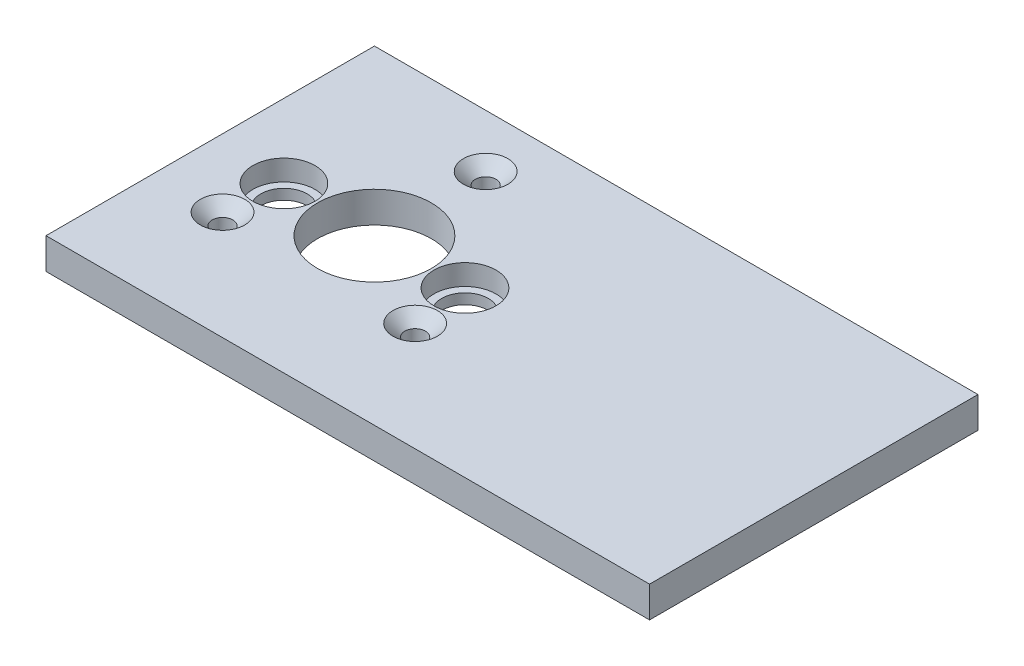
ISO-10303-21;
HEADER;
FILE_DESCRIPTION(('STEP AP214'),'2;1');
FILE_NAME('part.step','',(''),(''),'','','');
FILE_SCHEMA(('AUTOMOTIVE_DESIGN { 1 0 10303 214 1 1 1 1 }'));
ENDSEC;
DATA;
#1=APPLICATION_CONTEXT('core data for automotive mechanical design processes');
#2=APPLICATION_PROTOCOL_DEFINITION('international standard','automotive_design',2000,#1);
#3=PRODUCT_CONTEXT('',#1,'mechanical');
#4=PRODUCT('Part','Part','',(#3));
#5=PRODUCT_RELATED_PRODUCT_CATEGORY('part','',(#4));
#6=PRODUCT_DEFINITION_FORMATION('','',#4);
#7=PRODUCT_DEFINITION_CONTEXT('part definition',#1,'design');
#8=PRODUCT_DEFINITION('design','',#6,#7);
#9=PRODUCT_DEFINITION_SHAPE('','',#8);
#10=(LENGTH_UNIT() NAMED_UNIT(*) SI_UNIT(.MILLI.,.METRE.));
#11=(NAMED_UNIT(*) PLANE_ANGLE_UNIT() SI_UNIT($,.RADIAN.));
#12=(NAMED_UNIT(*) SI_UNIT($,.STERADIAN.) SOLID_ANGLE_UNIT());
#13=UNCERTAINTY_MEASURE_WITH_UNIT(LENGTH_MEASURE(1.E-05),#10,'distance_accuracy_value','');
#14=(GEOMETRIC_REPRESENTATION_CONTEXT(3) GLOBAL_UNCERTAINTY_ASSIGNED_CONTEXT((#13)) GLOBAL_UNIT_ASSIGNED_CONTEXT((#10,
#11,#12)) REPRESENTATION_CONTEXT('',''));
#15=CARTESIAN_POINT('',(0.,0.,0.));
#16=DIRECTION('',(0.,0.,1.));
#17=DIRECTION('',(1.,0.,0.));
#18=AXIS2_PLACEMENT_3D('',#15,#16,#17);
#19=CARTESIAN_POINT('',(17.5,6.,0.));
#20=DIRECTION('',(0.,-1.,0.));
#21=DIRECTION('',(0.,0.,-1.));
#22=AXIS2_PLACEMENT_3D('',#19,#20,#21);
#23=CYLINDRICAL_SURFACE('',#22,6.);
#24=CARTESIAN_POINT('',(17.5,6.,0.));
#25=DIRECTION('',(0.,1.,0.));
#26=DIRECTION('',(0.,0.,1.));
#27=AXIS2_PLACEMENT_3D('',#24,#25,#26);
#28=CIRCLE('',#27,6.);
#29=CARTESIAN_POINT('',(17.5,6.,6.));
#30=VERTEX_POINT('',#29);
#31=EDGE_CURVE('E226',#30,#30,#28,.T.);
#32=ORIENTED_EDGE('',*,*,#31,.T.);
#33=EDGE_LOOP('',(#32));
#34=FACE_BOUND('',#33,.T.);
#35=CARTESIAN_POINT('',(17.5,2.,0.));
#36=DIRECTION('',(0.,-1.,0.));
#37=DIRECTION('',(0.,0.,-1.));
#38=AXIS2_PLACEMENT_3D('',#35,#36,#37);
#39=CIRCLE('',#38,6.);
#40=CARTESIAN_POINT('',(17.5,2.,-6.));
#41=VERTEX_POINT('',#40);
#42=EDGE_CURVE('E207',#41,#41,#39,.T.);
#43=ORIENTED_EDGE('',*,*,#42,.T.);
#44=EDGE_LOOP('',(#43));
#45=FACE_BOUND('',#44,.T.);
#46=ADVANCED_FACE('F35',(#34,#45),#23,.F.);
#47=CARTESIAN_POINT('',(-17.5,6.,0.));
#48=DIRECTION('',(0.,-1.,0.));
#49=DIRECTION('',(0.,0.,-1.));
#50=AXIS2_PLACEMENT_3D('',#47,#48,#49);
#51=CYLINDRICAL_SURFACE('',#50,6.);
#52=CARTESIAN_POINT('',(-17.5,6.,0.));
#53=DIRECTION('',(0.,1.,0.));
#54=DIRECTION('',(0.,0.,1.));
#55=AXIS2_PLACEMENT_3D('',#52,#53,#54);
#56=CIRCLE('',#55,6.);
#57=CARTESIAN_POINT('',(-17.5,6.,6.));
#58=VERTEX_POINT('',#57);
#59=EDGE_CURVE('E219',#58,#58,#56,.T.);
#60=ORIENTED_EDGE('',*,*,#59,.T.);
#61=EDGE_LOOP('',(#60));
#62=FACE_BOUND('',#61,.T.);
#63=CARTESIAN_POINT('',(-17.5,2.,0.));
#64=DIRECTION('',(0.,-1.,0.));
#65=DIRECTION('',(0.,0.,-1.));
#66=AXIS2_PLACEMENT_3D('',#63,#64,#65);
#67=CIRCLE('',#66,6.);
#68=CARTESIAN_POINT('',(-17.5,2.,-6.));
#69=VERTEX_POINT('',#68);
#70=EDGE_CURVE('E215',#69,#69,#67,.T.);
#71=ORIENTED_EDGE('',*,*,#70,.T.);
#72=EDGE_LOOP('',(#71));
#73=FACE_BOUND('',#72,.T.);
#74=ADVANCED_FACE('F146',(#62,#73),#51,.F.);
#75=CARTESIAN_POINT('',(-31.75,6.,31.75));
#76=DIRECTION('',(0.,1.,0.));
#77=DIRECTION('',(0.,0.,1.));
#78=AXIS2_PLACEMENT_3D('',#75,#76,#77);
#79=PLANE('',#78);
#80=CARTESIAN_POINT('',(18.6195461813654,6.,10.7500000000001));
#81=DIRECTION('',(0.,1.,0.));
#82=DIRECTION('',(0.,0.,1.));
#83=AXIS2_PLACEMENT_3D('',#80,#81,#82);
#84=CIRCLE('',#83,4.30000000000001);
#85=CARTESIAN_POINT('',(18.6195461813654,6.,15.0500000000001));
#86=VERTEX_POINT('',#85);
#87=EDGE_CURVE('E123',#86,#86,#84,.F.);
#88=ORIENTED_EDGE('',*,*,#87,.T.);
#89=EDGE_LOOP('',(#88));
#90=FACE_BOUND('',#89,.T.);
#91=CARTESIAN_POINT('',(0.,6.,-21.5));
#92=DIRECTION('',(0.,1.,0.));
#93=DIRECTION('',(0.,0.,1.));
#94=AXIS2_PLACEMENT_3D('',#91,#92,#93);
#95=CIRCLE('',#94,4.30000000000005);
#96=CARTESIAN_POINT('',(0.,6.,-17.1999999999999));
#97=VERTEX_POINT('',#96);
#98=EDGE_CURVE('E120',#97,#97,#95,.F.);
#99=ORIENTED_EDGE('',*,*,#98,.T.);
#100=EDGE_LOOP('',(#99));
#101=FACE_BOUND('',#100,.T.);
#102=CARTESIAN_POINT('',(-18.6195461813655,6.,10.7499999999998));
#103=DIRECTION('',(0.,1.,0.));
#104=DIRECTION('',(0.,0.,1.));
#105=AXIS2_PLACEMENT_3D('',#102,#103,#104);
#106=CIRCLE('',#105,4.30000000000001);
#107=CARTESIAN_POINT('',(-18.6195461813655,6.,15.0499999999998));
#108=VERTEX_POINT('',#107);
#109=EDGE_CURVE('E117',#108,#108,#106,.F.);
#110=ORIENTED_EDGE('',*,*,#109,.T.);
#111=EDGE_LOOP('',(#110));
#112=FACE_BOUND('',#111,.T.);
#113=ORIENTED_EDGE('',*,*,#31,.F.);
#114=EDGE_LOOP('',(#113));
#115=FACE_BOUND('',#114,.T.);
#116=CARTESIAN_POINT('',(0.,6.,0.));
#117=DIRECTION('',(0.,1.,0.));
#118=DIRECTION('',(0.,0.,1.));
#119=AXIS2_PLACEMENT_3D('',#116,#117,#118);
#120=CIRCLE('',#119,11.);
#121=CARTESIAN_POINT('',(0.,6.,11.));
#122=VERTEX_POINT('',#121);
#123=EDGE_CURVE('E107',#122,#122,#120,.T.);
#124=ORIENTED_EDGE('',*,*,#123,.F.);
#125=EDGE_LOOP('',(#124));
#126=FACE_BOUND('',#125,.T.);
#127=DIRECTION('',(0.,0.,1.));
#128=VECTOR('',#127,1.);
#129=CARTESIAN_POINT('',(-31.75,6.,-31.75));
#130=LINE('',#129,#128);
#131=CARTESIAN_POINT('',(-31.75,6.,-31.75));
#132=VERTEX_POINT('',#131);
#133=CARTESIAN_POINT('',(-31.75,6.,31.75));
#134=VERTEX_POINT('',#133);
#135=EDGE_CURVE('E89',#132,#134,#130,.T.);
#136=ORIENTED_EDGE('',*,*,#135,.T.);
#137=DIRECTION('',(1.,0.,0.));
#138=VECTOR('',#137,1.);
#139=CARTESIAN_POINT('',(-31.75,6.,31.75));
#140=LINE('',#139,#138);
#141=CARTESIAN_POINT('',(84.9345024418893,6.,31.75));
#142=VERTEX_POINT('',#141);
#143=EDGE_CURVE('E83',#134,#142,#140,.T.);
#144=ORIENTED_EDGE('',*,*,#143,.T.);
#145=DIRECTION('',(0.,0.,-1.));
#146=VECTOR('',#145,1.);
#147=CARTESIAN_POINT('',(84.9345024418893,6.,-31.75));
#148=LINE('',#147,#146);
#149=CARTESIAN_POINT('',(84.9345024418893,6.,-31.75));
#150=VERTEX_POINT('',#149);
#151=EDGE_CURVE('E87',#142,#150,#148,.T.);
#152=ORIENTED_EDGE('',*,*,#151,.T.);
#153=DIRECTION('',(-1.,0.,0.));
#154=VECTOR('',#153,1.);
#155=CARTESIAN_POINT('',(-31.75,6.,-31.75));
#156=LINE('',#155,#154);
#157=EDGE_CURVE('E52',#150,#132,#156,.T.);
#158=ORIENTED_EDGE('',*,*,#157,.T.);
#159=EDGE_LOOP('',(#136,#144,#152,#158));
#160=FACE_BOUND('',#159,.T.);
#161=ORIENTED_EDGE('',*,*,#59,.F.);
#162=EDGE_LOOP('',(#161));
#163=FACE_BOUND('',#162,.T.);
#164=ADVANCED_FACE('F84',(#90,#101,#112,#115,#126,#160,#163),#79,.T.);
#165=CARTESIAN_POINT('',(-31.75,0.,31.75));
#166=DIRECTION('',(0.,1.,0.));
#167=DIRECTION('',(0.,0.,1.));
#168=AXIS2_PLACEMENT_3D('',#165,#166,#167);
#169=PLANE('',#168);
#170=CARTESIAN_POINT('',(-18.6195461813655,0.,10.7499999999998));
#171=DIRECTION('',(0.,1.,0.));
#172=DIRECTION('',(0.,0.,1.));
#173=AXIS2_PLACEMENT_3D('',#170,#171,#172);
#174=CIRCLE('',#173,2.);
#175=CARTESIAN_POINT('',(-18.6195461813655,0.,12.7499999999998));
#176=VERTEX_POINT('',#175);
#177=EDGE_CURVE('E222',#176,#176,#174,.T.);
#178=ORIENTED_EDGE('',*,*,#177,.T.);
#179=EDGE_LOOP('',(#178));
#180=FACE_BOUND('',#179,.T.);
#181=CARTESIAN_POINT('',(0.,0.,0.));
#182=DIRECTION('',(0.,1.,0.));
#183=DIRECTION('',(0.,0.,1.));
#184=AXIS2_PLACEMENT_3D('',#181,#182,#183);
#185=CIRCLE('',#184,11.);
#186=CARTESIAN_POINT('',(0.,0.,11.));
#187=VERTEX_POINT('',#186);
#188=EDGE_CURVE('E229',#187,#187,#185,.T.);
#189=ORIENTED_EDGE('',*,*,#188,.T.);
#190=EDGE_LOOP('',(#189));
#191=FACE_BOUND('',#190,.T.);
#192=DIRECTION('',(0.,0.,1.));
#193=VECTOR('',#192,1.);
#194=CARTESIAN_POINT('',(-31.75,0.,-31.75));
#195=LINE('',#194,#193);
#196=CARTESIAN_POINT('',(-31.75,0.,-31.75));
#197=VERTEX_POINT('',#196);
#198=CARTESIAN_POINT('',(-31.75,0.,31.75));
#199=VERTEX_POINT('',#198);
#200=EDGE_CURVE('E104',#197,#199,#195,.T.);
#201=ORIENTED_EDGE('',*,*,#200,.F.);
#202=DIRECTION('',(-1.,0.,0.));
#203=VECTOR('',#202,1.);
#204=CARTESIAN_POINT('',(-31.75,0.,-31.75));
#205=LINE('',#204,#203);
#206=CARTESIAN_POINT('',(84.9345024418893,0.,-31.75));
#207=VERTEX_POINT('',#206);
#208=EDGE_CURVE('E75',#207,#197,#205,.T.);
#209=ORIENTED_EDGE('',*,*,#208,.F.);
#210=DIRECTION('',(0.,0.,-1.));
#211=VECTOR('',#210,1.);
#212=CARTESIAN_POINT('',(84.9345024418893,0.,-31.75));
#213=LINE('',#212,#211);
#214=CARTESIAN_POINT('',(84.9345024418893,0.,31.75));
#215=VERTEX_POINT('',#214);
#216=EDGE_CURVE('E69',#215,#207,#213,.T.);
#217=ORIENTED_EDGE('',*,*,#216,.F.);
#218=DIRECTION('',(1.,0.,0.));
#219=VECTOR('',#218,1.);
#220=CARTESIAN_POINT('',(-31.75,0.,31.75));
#221=LINE('',#220,#219);
#222=EDGE_CURVE('E94',#199,#215,#221,.T.);
#223=ORIENTED_EDGE('',*,*,#222,.F.);
#224=EDGE_LOOP('',(#201,#209,#217,#223));
#225=FACE_BOUND('',#224,.T.);
#226=CARTESIAN_POINT('',(0.,0.,-21.5));
#227=DIRECTION('',(0.,1.,0.));
#228=DIRECTION('',(0.,0.,1.));
#229=AXIS2_PLACEMENT_3D('',#226,#227,#228);
#230=CIRCLE('',#229,2.);
#231=CARTESIAN_POINT('',(0.,0.,-19.5));
#232=VERTEX_POINT('',#231);
#233=EDGE_CURVE('E191',#232,#232,#230,.T.);
#234=ORIENTED_EDGE('',*,*,#233,.T.);
#235=EDGE_LOOP('',(#234));
#236=FACE_BOUND('',#235,.T.);
#237=CARTESIAN_POINT('',(18.6195461813654,0.,10.7500000000001));
#238=DIRECTION('',(0.,1.,0.));
#239=DIRECTION('',(0.,0.,1.));
#240=AXIS2_PLACEMENT_3D('',#237,#238,#239);
#241=CIRCLE('',#240,2.);
#242=CARTESIAN_POINT('',(18.6195461813654,0.,12.7500000000001));
#243=VERTEX_POINT('',#242);
#244=EDGE_CURVE('E195',#243,#243,#241,.T.);
#245=ORIENTED_EDGE('',*,*,#244,.T.);
#246=EDGE_LOOP('',(#245));
#247=FACE_BOUND('',#246,.T.);
#248=CARTESIAN_POINT('',(-17.5,0.,0.));
#249=DIRECTION('',(0.,-1.,0.));
#250=DIRECTION('',(0.,0.,-1.));
#251=AXIS2_PLACEMENT_3D('',#248,#249,#250);
#252=CIRCLE('',#251,4.5);
#253=CARTESIAN_POINT('',(-17.5,0.,-4.5));
#254=VERTEX_POINT('',#253);
#255=EDGE_CURVE('E199',#254,#254,#252,.T.);
#256=ORIENTED_EDGE('',*,*,#255,.F.);
#257=EDGE_LOOP('',(#256));
#258=FACE_BOUND('',#257,.T.);
#259=CARTESIAN_POINT('',(17.5,0.,0.));
#260=DIRECTION('',(0.,-1.,0.));
#261=DIRECTION('',(0.,0.,-1.));
#262=AXIS2_PLACEMENT_3D('',#259,#260,#261);
#263=CIRCLE('',#262,4.5);
#264=CARTESIAN_POINT('',(17.5,0.,-4.5));
#265=VERTEX_POINT('',#264);
#266=EDGE_CURVE('E202',#265,#265,#263,.T.);
#267=ORIENTED_EDGE('',*,*,#266,.F.);
#268=EDGE_LOOP('',(#267));
#269=FACE_BOUND('',#268,.T.);
#270=ADVANCED_FACE('F169',(#180,#191,#225,#236,#247,#258,#269),#169,.F.);
#271=CARTESIAN_POINT('',(-31.75,6.,-31.75));
#272=DIRECTION('',(1.,0.,0.));
#273=DIRECTION('',(0.,0.,-1.));
#274=AXIS2_PLACEMENT_3D('',#271,#272,#273);
#275=PLANE('',#274);
#276=ORIENTED_EDGE('',*,*,#200,.T.);
#277=DIRECTION('',(0.,-1.,0.));
#278=VECTOR('',#277,1.);
#279=CARTESIAN_POINT('',(-31.75,6.,31.75));
#280=LINE('',#279,#278);
#281=EDGE_CURVE('E95',#134,#199,#280,.T.);
#282=ORIENTED_EDGE('',*,*,#281,.F.);
#283=ORIENTED_EDGE('',*,*,#135,.F.);
#284=DIRECTION('',(0.,-1.,0.));
#285=VECTOR('',#284,1.);
#286=CARTESIAN_POINT('',(-31.75,6.,-31.75));
#287=LINE('',#286,#285);
#288=EDGE_CURVE('E100',#132,#197,#287,.T.);
#289=ORIENTED_EDGE('',*,*,#288,.T.);
#290=EDGE_LOOP('',(#276,#282,#283,#289));
#291=FACE_BOUND('',#290,.T.);
#292=ADVANCED_FACE('F173',(#291),#275,.F.);
#293=CARTESIAN_POINT('',(-31.75,6.,31.75));
#294=DIRECTION('',(0.,0.,-1.));
#295=DIRECTION('',(-1.,0.,0.));
#296=AXIS2_PLACEMENT_3D('',#293,#294,#295);
#297=PLANE('',#296);
#298=ORIENTED_EDGE('',*,*,#222,.T.);
#299=DIRECTION('',(0.,-1.,0.));
#300=VECTOR('',#299,1.);
#301=CARTESIAN_POINT('',(84.9345024418893,6.,31.75));
#302=LINE('',#301,#300);
#303=EDGE_CURVE('E92',#142,#215,#302,.T.);
#304=ORIENTED_EDGE('',*,*,#303,.F.);
#305=ORIENTED_EDGE('',*,*,#143,.F.);
#306=ORIENTED_EDGE('',*,*,#281,.T.);
#307=EDGE_LOOP('',(#298,#304,#305,#306));
#308=FACE_BOUND('',#307,.T.);
#309=ADVANCED_FACE('F93',(#308),#297,.F.);
#310=CARTESIAN_POINT('',(84.9345024418893,6.,-31.75));
#311=DIRECTION('',(-1.,0.,0.));
#312=DIRECTION('',(0.,0.,1.));
#313=AXIS2_PLACEMENT_3D('',#310,#311,#312);
#314=PLANE('',#313);
#315=ORIENTED_EDGE('',*,*,#216,.T.);
#316=DIRECTION('',(0.,-1.,0.));
#317=VECTOR('',#316,1.);
#318=CARTESIAN_POINT('',(84.9345024418893,6.,-31.75));
#319=LINE('',#318,#317);
#320=EDGE_CURVE('E96',#150,#207,#319,.T.);
#321=ORIENTED_EDGE('',*,*,#320,.F.);
#322=ORIENTED_EDGE('',*,*,#151,.F.);
#323=ORIENTED_EDGE('',*,*,#303,.T.);
#324=EDGE_LOOP('',(#315,#321,#322,#323));
#325=FACE_BOUND('',#324,.T.);
#326=ADVANCED_FACE('F98',(#325),#314,.F.);
#327=CARTESIAN_POINT('',(-31.75,6.,-31.75));
#328=DIRECTION('',(0.,0.,1.));
#329=DIRECTION('',(1.,0.,0.));
#330=AXIS2_PLACEMENT_3D('',#327,#328,#329);
#331=PLANE('',#330);
#332=ORIENTED_EDGE('',*,*,#208,.T.);
#333=ORIENTED_EDGE('',*,*,#288,.F.);
#334=ORIENTED_EDGE('',*,*,#157,.F.);
#335=ORIENTED_EDGE('',*,*,#320,.T.);
#336=EDGE_LOOP('',(#332,#333,#334,#335));
#337=FACE_BOUND('',#336,.T.);
#338=ADVANCED_FACE('F165',(#337),#331,.F.);
#339=CARTESIAN_POINT('',(0.,6.,0.));
#340=DIRECTION('',(0.,-1.,0.));
#341=DIRECTION('',(0.,0.,-1.));
#342=AXIS2_PLACEMENT_3D('',#339,#340,#341);
#343=CYLINDRICAL_SURFACE('',#342,11.);
#344=ORIENTED_EDGE('',*,*,#123,.T.);
#345=EDGE_LOOP('',(#344));
#346=FACE_BOUND('',#345,.T.);
#347=ORIENTED_EDGE('',*,*,#188,.F.);
#348=EDGE_LOOP('',(#347));
#349=FACE_BOUND('',#348,.T.);
#350=ADVANCED_FACE('F162',(#346,#349),#343,.F.);
#351=CARTESIAN_POINT('',(0.,6.,-21.5));
#352=DIRECTION('',(0.,-1.,0.));
#353=DIRECTION('',(0.,0.,-1.));
#354=AXIS2_PLACEMENT_3D('',#351,#352,#353);
#355=CYLINDRICAL_SURFACE('',#354,2.);
#356=CARTESIAN_POINT('',(0.,3.69999999999995,-21.5));
#357=DIRECTION('',(0.,1.,0.));
#358=DIRECTION('',(0.,0.,1.));
#359=AXIS2_PLACEMENT_3D('',#356,#357,#358);
#360=CIRCLE('',#359,2.);
#361=CARTESIAN_POINT('',(0.,3.69999999999995,-19.5));
#362=VERTEX_POINT('',#361);
#363=EDGE_CURVE('E44',#362,#362,#360,.T.);
#364=ORIENTED_EDGE('',*,*,#363,.T.);
#365=EDGE_LOOP('',(#364));
#366=FACE_BOUND('',#365,.T.);
#367=ORIENTED_EDGE('',*,*,#233,.F.);
#368=EDGE_LOOP('',(#367));
#369=FACE_BOUND('',#368,.T.);
#370=ADVANCED_FACE('F128',(#366,#369),#355,.F.);
#371=CARTESIAN_POINT('',(18.6195461813654,6.,10.7500000000001));
#372=DIRECTION('',(0.,-1.,0.));
#373=DIRECTION('',(0.,0.,-1.));
#374=AXIS2_PLACEMENT_3D('',#371,#372,#373);
#375=CYLINDRICAL_SURFACE('',#374,2.);
#376=CARTESIAN_POINT('',(18.6195461813654,3.69999999999998,10.7500000000001));
#377=DIRECTION('',(0.,1.,0.));
#378=DIRECTION('',(0.,0.,1.));
#379=AXIS2_PLACEMENT_3D('',#376,#377,#378);
#380=CIRCLE('',#379,2.);
#381=CARTESIAN_POINT('',(18.6195461813654,3.69999999999998,12.7500000000001));
#382=VERTEX_POINT('',#381);
#383=EDGE_CURVE('E114',#382,#382,#380,.T.);
#384=ORIENTED_EDGE('',*,*,#383,.T.);
#385=EDGE_LOOP('',(#384));
#386=FACE_BOUND('',#385,.T.);
#387=ORIENTED_EDGE('',*,*,#244,.F.);
#388=EDGE_LOOP('',(#387));
#389=FACE_BOUND('',#388,.T.);
#390=ADVANCED_FACE('F158',(#386,#389),#375,.F.);
#391=CARTESIAN_POINT('',(-18.6195461813655,6.,10.7499999999998));
#392=DIRECTION('',(0.,-1.,0.));
#393=DIRECTION('',(0.,0.,-1.));
#394=AXIS2_PLACEMENT_3D('',#391,#392,#393);
#395=CYLINDRICAL_SURFACE('',#394,2.);
#396=CARTESIAN_POINT('',(-18.6195461813655,3.69999999999998,10.7499999999998));
#397=DIRECTION('',(0.,1.,0.));
#398=DIRECTION('',(0.,0.,1.));
#399=AXIS2_PLACEMENT_3D('',#396,#397,#398);
#400=CIRCLE('',#399,2.);
#401=CARTESIAN_POINT('',(-18.6195461813655,3.69999999999998,12.7499999999998));
#402=VERTEX_POINT('',#401);
#403=EDGE_CURVE('E11',#402,#402,#400,.T.);
#404=ORIENTED_EDGE('',*,*,#403,.T.);
#405=EDGE_LOOP('',(#404));
#406=FACE_BOUND('',#405,.T.);
#407=ORIENTED_EDGE('',*,*,#177,.F.);
#408=EDGE_LOOP('',(#407));
#409=FACE_BOUND('',#408,.T.);
#410=ADVANCED_FACE('F141',(#406,#409),#395,.F.);
#411=CARTESIAN_POINT('',(18.6195461813654,3.69999999999998,10.7500000000001));
#412=DIRECTION('',(0.,1.,0.));
#413=DIRECTION('',(0.,0.,1.));
#414=AXIS2_PLACEMENT_3D('',#411,#412,#413);
#415=CONICAL_SURFACE('',#414,2.,0.785398163397447);
#416=ORIENTED_EDGE('',*,*,#87,.F.);
#417=EDGE_LOOP('',(#416));
#418=FACE_BOUND('',#417,.T.);
#419=ORIENTED_EDGE('',*,*,#383,.F.);
#420=EDGE_LOOP('',(#419));
#421=FACE_BOUND('',#420,.T.);
#422=ADVANCED_FACE('F133',(#418,#421),#415,.F.);
#423=CARTESIAN_POINT('',(0.,3.69999999999995,-21.5));
#424=DIRECTION('',(0.,1.,0.));
#425=DIRECTION('',(0.,0.,1.));
#426=AXIS2_PLACEMENT_3D('',#423,#424,#425);
#427=CONICAL_SURFACE('',#426,2.,0.78539816339745);
#428=ORIENTED_EDGE('',*,*,#98,.F.);
#429=EDGE_LOOP('',(#428));
#430=FACE_BOUND('',#429,.T.);
#431=ORIENTED_EDGE('',*,*,#363,.F.);
#432=EDGE_LOOP('',(#431));
#433=FACE_BOUND('',#432,.T.);
#434=ADVANCED_FACE('F131',(#430,#433),#427,.F.);
#435=CARTESIAN_POINT('',(-18.6195461813655,3.69999999999998,10.7499999999998));
#436=DIRECTION('',(0.,1.,0.));
#437=DIRECTION('',(0.,0.,1.));
#438=AXIS2_PLACEMENT_3D('',#435,#436,#437);
#439=CONICAL_SURFACE('',#438,2.,0.785398163397447);
#440=ORIENTED_EDGE('',*,*,#109,.F.);
#441=EDGE_LOOP('',(#440));
#442=FACE_BOUND('',#441,.T.);
#443=ORIENTED_EDGE('',*,*,#403,.F.);
#444=EDGE_LOOP('',(#443));
#445=FACE_BOUND('',#444,.T.);
#446=ADVANCED_FACE('F37',(#442,#445),#439,.F.);
#447=CARTESIAN_POINT('',(-17.5,2.,0.));
#448=DIRECTION('',(0.,-1.,0.));
#449=DIRECTION('',(0.,0.,-1.));
#450=AXIS2_PLACEMENT_3D('',#447,#448,#449);
#451=PLANE('',#450);
#452=CARTESIAN_POINT('',(-17.5,2.,0.));
#453=DIRECTION('',(0.,-1.,0.));
#454=DIRECTION('',(0.,0.,-1.));
#455=AXIS2_PLACEMENT_3D('',#452,#453,#454);
#456=CIRCLE('',#455,4.5);
#457=CARTESIAN_POINT('',(-17.5,2.,-4.5));
#458=VERTEX_POINT('',#457);
#459=EDGE_CURVE('E212',#458,#458,#456,.T.);
#460=ORIENTED_EDGE('',*,*,#459,.T.);
#461=EDGE_LOOP('',(#460));
#462=FACE_BOUND('',#461,.T.);
#463=ORIENTED_EDGE('',*,*,#70,.F.);
#464=EDGE_LOOP('',(#463));
#465=FACE_BOUND('',#464,.T.);
#466=ADVANCED_FACE('F139',(#462,#465),#451,.F.);
#467=CARTESIAN_POINT('',(-17.5,2.,0.));
#468=DIRECTION('',(0.,-1.,0.));
#469=DIRECTION('',(0.,0.,-1.));
#470=AXIS2_PLACEMENT_3D('',#467,#468,#469);
#471=CYLINDRICAL_SURFACE('',#470,4.5);
#472=ORIENTED_EDGE('',*,*,#459,.F.);
#473=EDGE_LOOP('',(#472));
#474=FACE_BOUND('',#473,.T.);
#475=ORIENTED_EDGE('',*,*,#255,.T.);
#476=EDGE_LOOP('',(#475));
#477=FACE_BOUND('',#476,.T.);
#478=ADVANCED_FACE('F251',(#474,#477),#471,.F.);
#479=CARTESIAN_POINT('',(17.5,2.,0.));
#480=DIRECTION('',(0.,-1.,0.));
#481=DIRECTION('',(0.,0.,-1.));
#482=AXIS2_PLACEMENT_3D('',#479,#480,#481);
#483=PLANE('',#482);
#484=CARTESIAN_POINT('',(17.5,2.,0.));
#485=DIRECTION('',(0.,-1.,0.));
#486=DIRECTION('',(0.,0.,-1.));
#487=AXIS2_PLACEMENT_3D('',#484,#485,#486);
#488=CIRCLE('',#487,4.5);
#489=CARTESIAN_POINT('',(17.5,2.,-4.5));
#490=VERTEX_POINT('',#489);
#491=EDGE_CURVE('E204',#490,#490,#488,.T.);
#492=ORIENTED_EDGE('',*,*,#491,.T.);
#493=EDGE_LOOP('',(#492));
#494=FACE_BOUND('',#493,.T.);
#495=ORIENTED_EDGE('',*,*,#42,.F.);
#496=EDGE_LOOP('',(#495));
#497=FACE_BOUND('',#496,.T.);
#498=ADVANCED_FACE('F255',(#494,#497),#483,.F.);
#499=CARTESIAN_POINT('',(17.5,2.,0.));
#500=DIRECTION('',(0.,-1.,0.));
#501=DIRECTION('',(0.,0.,-1.));
#502=AXIS2_PLACEMENT_3D('',#499,#500,#501);
#503=CYLINDRICAL_SURFACE('',#502,4.5);
#504=ORIENTED_EDGE('',*,*,#491,.F.);
#505=EDGE_LOOP('',(#504));
#506=FACE_BOUND('',#505,.T.);
#507=ORIENTED_EDGE('',*,*,#266,.T.);
#508=EDGE_LOOP('',(#507));
#509=FACE_BOUND('',#508,.T.);
#510=ADVANCED_FACE('F259',(#506,#509),#503,.F.);
#511=CLOSED_SHELL('',(#46,#74,#164,#270,#292,#309,#326,#338,#350,#370,#390,#410,#422,#434,#446,
#466,#478,#498,#510));
#512=MANIFOLD_SOLID_BREP('B2',#511);
#513=ADVANCED_BREP_SHAPE_REPRESENTATION('',(#18,#512),#14);
#514=SHAPE_DEFINITION_REPRESENTATION(#9,#513);
ENDSEC;
END-ISO-10303-21;
